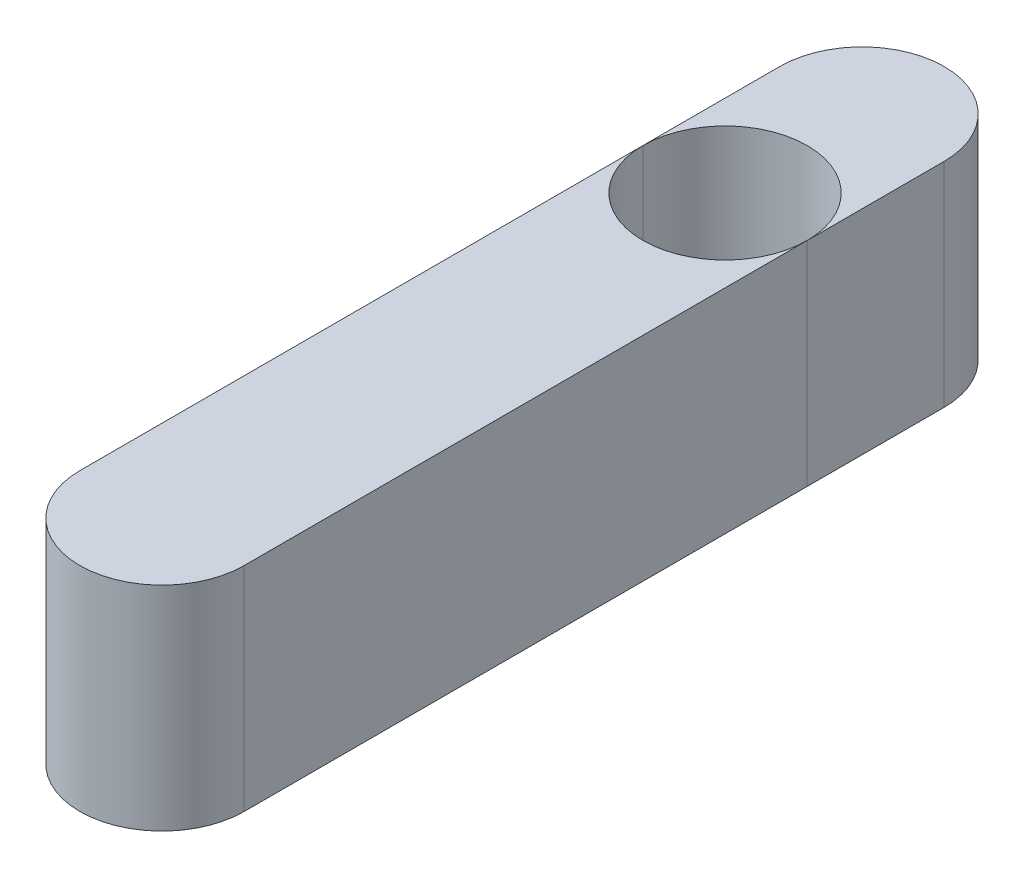
ISO-10303-21;
HEADER;
FILE_DESCRIPTION(('STEP AP214'),'2;1');
FILE_NAME('part.step','',(''),(''),'','','');
FILE_SCHEMA(('AUTOMOTIVE_DESIGN { 1 0 10303 214 1 1 1 1 }'));
ENDSEC;
DATA;
#1=APPLICATION_CONTEXT('core data for automotive mechanical design processes');
#2=APPLICATION_PROTOCOL_DEFINITION('international standard','automotive_design',2000,#1);
#3=PRODUCT_CONTEXT('',#1,'mechanical');
#4=PRODUCT('Part','Part','',(#3));
#5=PRODUCT_RELATED_PRODUCT_CATEGORY('part','',(#4));
#6=PRODUCT_DEFINITION_FORMATION('','',#4);
#7=PRODUCT_DEFINITION_CONTEXT('part definition',#1,'design');
#8=PRODUCT_DEFINITION('design','',#6,#7);
#9=PRODUCT_DEFINITION_SHAPE('','',#8);
#10=(LENGTH_UNIT() NAMED_UNIT(*) SI_UNIT(.MILLI.,.METRE.));
#11=(NAMED_UNIT(*) PLANE_ANGLE_UNIT() SI_UNIT($,.RADIAN.));
#12=(NAMED_UNIT(*) SI_UNIT($,.STERADIAN.) SOLID_ANGLE_UNIT());
#13=UNCERTAINTY_MEASURE_WITH_UNIT(LENGTH_MEASURE(1.E-05),#10,'distance_accuracy_value','');
#14=(GEOMETRIC_REPRESENTATION_CONTEXT(3) GLOBAL_UNCERTAINTY_ASSIGNED_CONTEXT((#13)) GLOBAL_UNIT_ASSIGNED_CONTEXT((#10,
#11,#12)) REPRESENTATION_CONTEXT('',''));
#15=CARTESIAN_POINT('',(0.,0.,0.));
#16=DIRECTION('',(0.,0.,1.));
#17=DIRECTION('',(1.,0.,0.));
#18=AXIS2_PLACEMENT_3D('',#15,#16,#17);
#19=CARTESIAN_POINT('',(2.7,7.,0.));
#20=DIRECTION('',(-1.,0.,0.));
#21=DIRECTION('',(0.,0.,1.));
#22=AXIS2_PLACEMENT_3D('',#19,#20,#21);
#23=PLANE('',#22);
#24=DIRECTION('',(0.,1.,0.));
#25=VECTOR('',#24,1.);
#26=CARTESIAN_POINT('',(2.7,0.,-18.5));
#27=LINE('',#26,#25);
#28=CARTESIAN_POINT('',(2.7,0.,-18.5));
#29=VERTEX_POINT('',#28);
#30=CARTESIAN_POINT('',(2.7,7.,-18.5));
#31=VERTEX_POINT('',#30);
#32=EDGE_CURVE('E51',#29,#31,#27,.T.);
#33=ORIENTED_EDGE('',*,*,#32,.F.);
#34=DIRECTION('',(0.,0.,-1.));
#35=VECTOR('',#34,1.);
#36=CARTESIAN_POINT('',(2.7,0.,0.));
#37=LINE('',#36,#35);
#38=CARTESIAN_POINT('',(2.7,0.,-23.));
#39=VERTEX_POINT('',#38);
#40=EDGE_CURVE('E90',#29,#39,#37,.T.);
#41=ORIENTED_EDGE('',*,*,#40,.T.);
#42=DIRECTION('',(0.,-1.,0.));
#43=VECTOR('',#42,1.);
#44=CARTESIAN_POINT('',(2.7,7.,-23.));
#45=LINE('',#44,#43);
#46=CARTESIAN_POINT('',(2.7,7.,-23.));
#47=VERTEX_POINT('',#46);
#48=EDGE_CURVE('E93',#47,#39,#45,.T.);
#49=ORIENTED_EDGE('',*,*,#48,.F.);
#50=DIRECTION('',(0.,0.,-1.));
#51=VECTOR('',#50,1.);
#52=CARTESIAN_POINT('',(2.7,7.,0.));
#53=LINE('',#52,#51);
#54=EDGE_CURVE('E82',#31,#47,#53,.T.);
#55=ORIENTED_EDGE('',*,*,#54,.F.);
#56=EDGE_LOOP('',(#33,#41,#49,#55));
#57=FACE_BOUND('',#56,.T.);
#58=ADVANCED_FACE('F43',(#57),#23,.F.);
#59=CARTESIAN_POINT('',(0.,7.,0.));
#60=DIRECTION('',(0.,1.,0.));
#61=DIRECTION('',(0.,0.,1.));
#62=AXIS2_PLACEMENT_3D('',#59,#60,#61);
#63=PLANE('',#62);
#64=CARTESIAN_POINT('',(0.,7.,-18.5));
#65=DIRECTION('',(0.,1.,0.));
#66=DIRECTION('',(0.,0.,1.));
#67=AXIS2_PLACEMENT_3D('',#64,#65,#66);
#68=CIRCLE('',#67,2.7);
#69=CARTESIAN_POINT('',(-2.7,7.,-18.5));
#70=VERTEX_POINT('',#69);
#71=EDGE_CURVE('E12',#31,#70,#68,.T.);
#72=ORIENTED_EDGE('',*,*,#71,.F.);
#73=ORIENTED_EDGE('',*,*,#54,.T.);
#74=CARTESIAN_POINT('',(0.,7.,-23.));
#75=DIRECTION('',(0.,1.,0.));
#76=DIRECTION('',(0.,0.,1.));
#77=AXIS2_PLACEMENT_3D('',#74,#75,#76);
#78=CIRCLE('',#77,2.7);
#79=CARTESIAN_POINT('',(-2.7,7.,-23.));
#80=VERTEX_POINT('',#79);
#81=EDGE_CURVE('E87',#47,#80,#78,.T.);
#82=ORIENTED_EDGE('',*,*,#81,.T.);
#83=DIRECTION('',(0.,0.,1.));
#84=VECTOR('',#83,1.);
#85=CARTESIAN_POINT('',(-2.7,7.,0.));
#86=LINE('',#85,#84);
#87=EDGE_CURVE('E104',#80,#70,#86,.T.);
#88=ORIENTED_EDGE('',*,*,#87,.T.);
#89=EDGE_LOOP('',(#72,#73,#82,#88));
#90=FACE_BOUND('',#89,.T.);
#91=ADVANCED_FACE('F84',(#90),#63,.T.);
#92=CARTESIAN_POINT('',(0.,0.,0.));
#93=DIRECTION('',(0.,1.,0.));
#94=DIRECTION('',(0.,0.,1.));
#95=AXIS2_PLACEMENT_3D('',#92,#93,#94);
#96=PLANE('',#95);
#97=ORIENTED_EDGE('',*,*,#40,.F.);
#98=CARTESIAN_POINT('',(0.,0.,-18.5));
#99=DIRECTION('',(0.,1.,0.));
#100=DIRECTION('',(0.,0.,1.));
#101=AXIS2_PLACEMENT_3D('',#98,#99,#100);
#102=CIRCLE('',#101,2.7);
#103=CARTESIAN_POINT('',(-2.7,0.,-18.5));
#104=VERTEX_POINT('',#103);
#105=EDGE_CURVE('E58',#29,#104,#102,.T.);
#106=ORIENTED_EDGE('',*,*,#105,.T.);
#107=DIRECTION('',(0.,0.,1.));
#108=VECTOR('',#107,1.);
#109=CARTESIAN_POINT('',(-2.7,0.,0.));
#110=LINE('',#109,#108);
#111=CARTESIAN_POINT('',(-2.7,0.,-23.));
#112=VERTEX_POINT('',#111);
#113=EDGE_CURVE('E97',#112,#104,#110,.T.);
#114=ORIENTED_EDGE('',*,*,#113,.F.);
#115=CARTESIAN_POINT('',(0.,0.,-23.));
#116=DIRECTION('',(0.,1.,0.));
#117=DIRECTION('',(0.,0.,1.));
#118=AXIS2_PLACEMENT_3D('',#115,#116,#117);
#119=CIRCLE('',#118,2.7);
#120=EDGE_CURVE('E98',#39,#112,#119,.T.);
#121=ORIENTED_EDGE('',*,*,#120,.F.);
#122=EDGE_LOOP('',(#97,#106,#114,#121));
#123=FACE_BOUND('',#122,.T.);
#124=ADVANCED_FACE('F117',(#123),#96,.F.);
#125=CARTESIAN_POINT('',(0.,7.,-23.));
#126=DIRECTION('',(0.,-1.,0.));
#127=DIRECTION('',(0.,0.,-1.));
#128=AXIS2_PLACEMENT_3D('',#125,#126,#127);
#129=CYLINDRICAL_SURFACE('',#128,2.7);
#130=ORIENTED_EDGE('',*,*,#120,.T.);
#131=DIRECTION('',(0.,-1.,0.));
#132=VECTOR('',#131,1.);
#133=CARTESIAN_POINT('',(-2.7,7.,-23.));
#134=LINE('',#133,#132);
#135=EDGE_CURVE('E102',#80,#112,#134,.T.);
#136=ORIENTED_EDGE('',*,*,#135,.F.);
#137=ORIENTED_EDGE('',*,*,#81,.F.);
#138=ORIENTED_EDGE('',*,*,#48,.T.);
#139=EDGE_LOOP('',(#130,#136,#137,#138));
#140=FACE_BOUND('',#139,.T.);
#141=ADVANCED_FACE('F100',(#140),#129,.T.);
#142=CARTESIAN_POINT('',(-2.7,7.,0.));
#143=DIRECTION('',(1.,0.,0.));
#144=DIRECTION('',(0.,0.,-1.));
#145=AXIS2_PLACEMENT_3D('',#142,#143,#144);
#146=PLANE('',#145);
#147=ORIENTED_EDGE('',*,*,#113,.T.);
#148=DIRECTION('',(0.,1.,0.));
#149=VECTOR('',#148,1.);
#150=CARTESIAN_POINT('',(-2.7,0.,-18.5));
#151=LINE('',#150,#149);
#152=EDGE_CURVE('E63',#104,#70,#151,.T.);
#153=ORIENTED_EDGE('',*,*,#152,.T.);
#154=ORIENTED_EDGE('',*,*,#87,.F.);
#155=ORIENTED_EDGE('',*,*,#135,.T.);
#156=EDGE_LOOP('',(#147,#153,#154,#155));
#157=FACE_BOUND('',#156,.T.);
#158=ADVANCED_FACE('F115',(#157),#146,.F.);
#159=CARTESIAN_POINT('',(0.,0.,-18.5));
#160=DIRECTION('',(0.,1.,0.));
#161=DIRECTION('',(0.,0.,1.));
#162=AXIS2_PLACEMENT_3D('',#159,#160,#161);
#163=CYLINDRICAL_SURFACE('',#162,2.7);
#164=ORIENTED_EDGE('',*,*,#32,.T.);
#165=ORIENTED_EDGE('',*,*,#71,.T.);
#166=ORIENTED_EDGE('',*,*,#152,.F.);
#167=ORIENTED_EDGE('',*,*,#105,.F.);
#168=EDGE_LOOP('',(#164,#165,#166,#167));
#169=FACE_BOUND('',#168,.T.);
#170=ADVANCED_FACE('F45',(#169),#163,.F.);
#171=CLOSED_SHELL('',(#58,#91,#124,#141,#158,#170));
#172=MANIFOLD_SOLID_BREP('B2',#171);
#173=CARTESIAN_POINT('',(0.,7.,0.));
#174=DIRECTION('',(0.,-1.,0.));
#175=DIRECTION('',(0.,0.,-1.));
#176=AXIS2_PLACEMENT_3D('',#173,#174,#175);
#177=CYLINDRICAL_SURFACE('',#176,2.7);
#178=CARTESIAN_POINT('',(0.,0.,0.));
#179=DIRECTION('',(0.,1.,0.));
#180=DIRECTION('',(0.,0.,1.));
#181=AXIS2_PLACEMENT_3D('',#178,#179,#180);
#182=CIRCLE('',#181,2.7);
#183=CARTESIAN_POINT('',(-2.7,0.,0.));
#184=VERTEX_POINT('',#183);
#185=CARTESIAN_POINT('',(2.7,0.,0.));
#186=VERTEX_POINT('',#185);
#187=EDGE_CURVE('E217',#184,#186,#182,.T.);
#188=ORIENTED_EDGE('',*,*,#187,.T.);
#189=DIRECTION('',(0.,-1.,0.));
#190=VECTOR('',#189,1.);
#191=CARTESIAN_POINT('',(2.7,7.,0.));
#192=LINE('',#191,#190);
#193=CARTESIAN_POINT('',(2.7,7.,0.));
#194=VERTEX_POINT('',#193);
#195=EDGE_CURVE('E206',#194,#186,#192,.T.);
#196=ORIENTED_EDGE('',*,*,#195,.F.);
#197=CARTESIAN_POINT('',(0.,7.,0.));
#198=DIRECTION('',(0.,1.,0.));
#199=DIRECTION('',(0.,0.,1.));
#200=AXIS2_PLACEMENT_3D('',#197,#198,#199);
#201=CIRCLE('',#200,2.7);
#202=CARTESIAN_POINT('',(-2.7,7.,0.));
#203=VERTEX_POINT('',#202);
#204=EDGE_CURVE('E218',#203,#194,#201,.T.);
#205=ORIENTED_EDGE('',*,*,#204,.F.);
#206=DIRECTION('',(0.,-1.,0.));
#207=VECTOR('',#206,1.);
#208=CARTESIAN_POINT('',(-2.7,7.,0.));
#209=LINE('',#208,#207);
#210=EDGE_CURVE('E227',#203,#184,#209,.T.);
#211=ORIENTED_EDGE('',*,*,#210,.T.);
#212=EDGE_LOOP('',(#188,#196,#205,#211));
#213=FACE_BOUND('',#212,.T.);
#214=ADVANCED_FACE('F167',(#213),#177,.T.);
#215=CARTESIAN_POINT('',(0.,7.,0.));
#216=DIRECTION('',(0.,1.,0.));
#217=DIRECTION('',(0.,0.,1.));
#218=AXIS2_PLACEMENT_3D('',#215,#216,#217);
#219=PLANE('',#218);
#220=CARTESIAN_POINT('',(0.,7.,-18.5));
#221=DIRECTION('',(0.,1.,0.));
#222=DIRECTION('',(0.,0.,1.));
#223=AXIS2_PLACEMENT_3D('',#220,#221,#222);
#224=CIRCLE('',#223,2.7);
#225=CARTESIAN_POINT('',(-2.7,7.,-18.5));
#226=VERTEX_POINT('',#225);
#227=CARTESIAN_POINT('',(2.7,7.,-18.5));
#228=VERTEX_POINT('',#227);
#229=EDGE_CURVE('E235',#226,#228,#224,.T.);
#230=ORIENTED_EDGE('',*,*,#229,.F.);
#231=DIRECTION('',(0.,0.,1.));
#232=VECTOR('',#231,1.);
#233=CARTESIAN_POINT('',(-2.7,7.,0.));
#234=LINE('',#233,#232);
#235=EDGE_CURVE('E212',#226,#203,#234,.T.);
#236=ORIENTED_EDGE('',*,*,#235,.T.);
#237=ORIENTED_EDGE('',*,*,#204,.T.);
#238=DIRECTION('',(0.,0.,-1.));
#239=VECTOR('',#238,1.);
#240=CARTESIAN_POINT('',(2.7,7.,0.));
#241=LINE('',#240,#239);
#242=EDGE_CURVE('E222',#194,#228,#241,.T.);
#243=ORIENTED_EDGE('',*,*,#242,.T.);
#244=EDGE_LOOP('',(#230,#236,#237,#243));
#245=FACE_BOUND('',#244,.T.);
#246=ADVANCED_FACE('F241',(#245),#219,.T.);
#247=CARTESIAN_POINT('',(0.,0.,0.));
#248=DIRECTION('',(0.,1.,0.));
#249=DIRECTION('',(0.,0.,1.));
#250=AXIS2_PLACEMENT_3D('',#247,#248,#249);
#251=PLANE('',#250);
#252=DIRECTION('',(0.,0.,1.));
#253=VECTOR('',#252,1.);
#254=CARTESIAN_POINT('',(-2.7,0.,0.));
#255=LINE('',#254,#253);
#256=CARTESIAN_POINT('',(-2.7,0.,-18.5));
#257=VERTEX_POINT('',#256);
#258=EDGE_CURVE('E210',#257,#184,#255,.T.);
#259=ORIENTED_EDGE('',*,*,#258,.F.);
#260=CARTESIAN_POINT('',(0.,0.,-18.5));
#261=DIRECTION('',(0.,1.,0.));
#262=DIRECTION('',(0.,0.,1.));
#263=AXIS2_PLACEMENT_3D('',#260,#261,#262);
#264=CIRCLE('',#263,2.7);
#265=CARTESIAN_POINT('',(2.7,0.,-18.5));
#266=VERTEX_POINT('',#265);
#267=EDGE_CURVE('E170',#257,#266,#264,.T.);
#268=ORIENTED_EDGE('',*,*,#267,.T.);
#269=DIRECTION('',(0.,0.,-1.));
#270=VECTOR('',#269,1.);
#271=CARTESIAN_POINT('',(2.7,0.,0.));
#272=LINE('',#271,#270);
#273=EDGE_CURVE('E219',#186,#266,#272,.T.);
#274=ORIENTED_EDGE('',*,*,#273,.F.);
#275=ORIENTED_EDGE('',*,*,#187,.F.);
#276=EDGE_LOOP('',(#259,#268,#274,#275));
#277=FACE_BOUND('',#276,.T.);
#278=ADVANCED_FACE('F215',(#277),#251,.F.);
#279=CARTESIAN_POINT('',(-2.7,7.,0.));
#280=DIRECTION('',(1.,0.,0.));
#281=DIRECTION('',(0.,0.,-1.));
#282=AXIS2_PLACEMENT_3D('',#279,#280,#281);
#283=PLANE('',#282);
#284=DIRECTION('',(0.,1.,0.));
#285=VECTOR('',#284,1.);
#286=CARTESIAN_POINT('',(-2.7,0.,-18.5));
#287=LINE('',#286,#285);
#288=EDGE_CURVE('E41',#257,#226,#287,.T.);
#289=ORIENTED_EDGE('',*,*,#288,.F.);
#290=ORIENTED_EDGE('',*,*,#258,.T.);
#291=ORIENTED_EDGE('',*,*,#210,.F.);
#292=ORIENTED_EDGE('',*,*,#235,.F.);
#293=EDGE_LOOP('',(#289,#290,#291,#292));
#294=FACE_BOUND('',#293,.T.);
#295=ADVANCED_FACE('F208',(#294),#283,.F.);
#296=CARTESIAN_POINT('',(2.7,7.,0.));
#297=DIRECTION('',(-1.,0.,0.));
#298=DIRECTION('',(0.,0.,1.));
#299=AXIS2_PLACEMENT_3D('',#296,#297,#298);
#300=PLANE('',#299);
#301=ORIENTED_EDGE('',*,*,#273,.T.);
#302=DIRECTION('',(0.,1.,0.));
#303=VECTOR('',#302,1.);
#304=CARTESIAN_POINT('',(2.7,0.,-18.5));
#305=LINE('',#304,#303);
#306=EDGE_CURVE('E175',#266,#228,#305,.T.);
#307=ORIENTED_EDGE('',*,*,#306,.T.);
#308=ORIENTED_EDGE('',*,*,#242,.F.);
#309=ORIENTED_EDGE('',*,*,#195,.T.);
#310=EDGE_LOOP('',(#301,#307,#308,#309));
#311=FACE_BOUND('',#310,.T.);
#312=ADVANCED_FACE('F231',(#311),#300,.F.);
#313=CARTESIAN_POINT('',(0.,0.,-18.5));
#314=DIRECTION('',(0.,1.,0.));
#315=DIRECTION('',(0.,0.,1.));
#316=AXIS2_PLACEMENT_3D('',#313,#314,#315);
#317=CYLINDRICAL_SURFACE('',#316,2.7);
#318=ORIENTED_EDGE('',*,*,#267,.F.);
#319=ORIENTED_EDGE('',*,*,#288,.T.);
#320=ORIENTED_EDGE('',*,*,#229,.T.);
#321=ORIENTED_EDGE('',*,*,#306,.F.);
#322=EDGE_LOOP('',(#318,#319,#320,#321));
#323=FACE_BOUND('',#322,.T.);
#324=ADVANCED_FACE('F203',(#323),#317,.F.);
#325=CLOSED_SHELL('',(#214,#246,#278,#295,#312,#324));
#326=MANIFOLD_SOLID_BREP('B6',#325);
#327=ADVANCED_BREP_SHAPE_REPRESENTATION('',(#18,#172,#326),#14);
#328=SHAPE_DEFINITION_REPRESENTATION(#9,#327);
ENDSEC;
END-ISO-10303-21;
